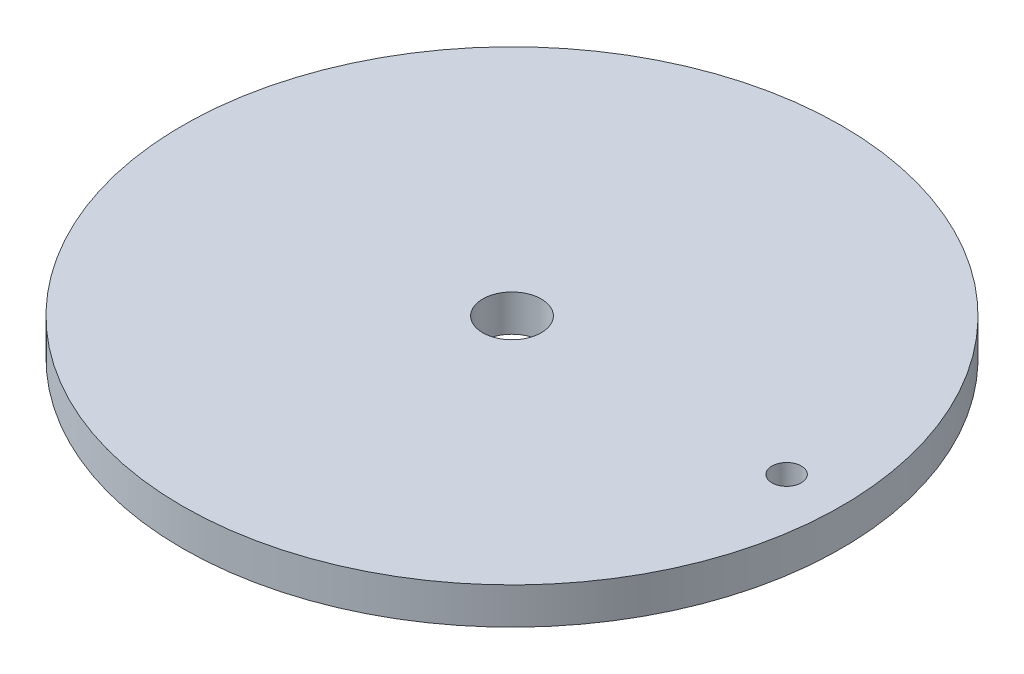
ISO-10303-21;
HEADER;
FILE_DESCRIPTION(('STEP AP214'),'2;1');
FILE_NAME('part.step','',(''),(''),'','','');
FILE_SCHEMA(('AUTOMOTIVE_DESIGN { 1 0 10303 214 1 1 1 1 }'));
ENDSEC;
DATA;
#1=APPLICATION_CONTEXT('core data for automotive mechanical design processes');
#2=APPLICATION_PROTOCOL_DEFINITION('international standard','automotive_design',2000,#1);
#3=PRODUCT_CONTEXT('',#1,'mechanical');
#4=PRODUCT('Part','Part','',(#3));
#5=PRODUCT_RELATED_PRODUCT_CATEGORY('part','',(#4));
#6=PRODUCT_DEFINITION_FORMATION('','',#4);
#7=PRODUCT_DEFINITION_CONTEXT('part definition',#1,'design');
#8=PRODUCT_DEFINITION('design','',#6,#7);
#9=PRODUCT_DEFINITION_SHAPE('','',#8);
#10=(LENGTH_UNIT() NAMED_UNIT(*) SI_UNIT(.MILLI.,.METRE.));
#11=(NAMED_UNIT(*) PLANE_ANGLE_UNIT() SI_UNIT($,.RADIAN.));
#12=(NAMED_UNIT(*) SI_UNIT($,.STERADIAN.) SOLID_ANGLE_UNIT());
#13=UNCERTAINTY_MEASURE_WITH_UNIT(LENGTH_MEASURE(1.E-05),#10,'distance_accuracy_value','');
#14=(GEOMETRIC_REPRESENTATION_CONTEXT(3) GLOBAL_UNCERTAINTY_ASSIGNED_CONTEXT((#13)) GLOBAL_UNIT_ASSIGNED_CONTEXT((#10,
#11,#12)) REPRESENTATION_CONTEXT('',''));
#15=CARTESIAN_POINT('',(0.,0.,0.));
#16=DIRECTION('',(0.,0.,1.));
#17=DIRECTION('',(1.,0.,0.));
#18=AXIS2_PLACEMENT_3D('',#15,#16,#17);
#19=CARTESIAN_POINT('',(0.,5.,0.));
#20=DIRECTION('',(0.,-1.,0.));
#21=DIRECTION('',(0.,0.,-1.));
#22=AXIS2_PLACEMENT_3D('',#19,#20,#21);
#23=CYLINDRICAL_SURFACE('',#22,45.);
#24=CARTESIAN_POINT('',(0.,5.,0.));
#25=DIRECTION('',(0.,1.,0.));
#26=DIRECTION('',(0.,0.,1.));
#27=AXIS2_PLACEMENT_3D('',#24,#25,#26);
#28=CIRCLE('',#27,45.);
#29=CARTESIAN_POINT('',(0.,5.,45.));
#30=VERTEX_POINT('',#29);
#31=EDGE_CURVE('E54',#30,#30,#28,.T.);
#32=ORIENTED_EDGE('',*,*,#31,.F.);
#33=EDGE_LOOP('',(#32));
#34=FACE_BOUND('',#33,.T.);
#35=CARTESIAN_POINT('',(0.,0.,0.));
#36=DIRECTION('',(0.,1.,0.));
#37=DIRECTION('',(0.,0.,1.));
#38=AXIS2_PLACEMENT_3D('',#35,#36,#37);
#39=CIRCLE('',#38,45.);
#40=CARTESIAN_POINT('',(0.,0.,45.));
#41=VERTEX_POINT('',#40);
#42=EDGE_CURVE('E67',#41,#41,#39,.T.);
#43=ORIENTED_EDGE('',*,*,#42,.T.);
#44=EDGE_LOOP('',(#43));
#45=FACE_BOUND('',#44,.T.);
#46=ADVANCED_FACE('F45',(#34,#45),#23,.T.);
#47=CARTESIAN_POINT('',(0.,5.,0.));
#48=DIRECTION('',(0.,-1.,0.));
#49=DIRECTION('',(0.,0.,-1.));
#50=AXIS2_PLACEMENT_3D('',#47,#48,#49);
#51=CYLINDRICAL_SURFACE('',#50,4.);
#52=CARTESIAN_POINT('',(0.,5.,0.));
#53=DIRECTION('',(0.,1.,0.));
#54=DIRECTION('',(0.,0.,1.));
#55=AXIS2_PLACEMENT_3D('',#52,#53,#54);
#56=CIRCLE('',#55,4.);
#57=CARTESIAN_POINT('',(0.,5.,4.));
#58=VERTEX_POINT('',#57);
#59=EDGE_CURVE('E60',#58,#58,#56,.T.);
#60=ORIENTED_EDGE('',*,*,#59,.T.);
#61=EDGE_LOOP('',(#60));
#62=FACE_BOUND('',#61,.T.);
#63=CARTESIAN_POINT('',(0.,0.,0.));
#64=DIRECTION('',(0.,1.,0.));
#65=DIRECTION('',(0.,0.,1.));
#66=AXIS2_PLACEMENT_3D('',#63,#64,#65);
#67=CIRCLE('',#66,4.);
#68=CARTESIAN_POINT('',(0.,0.,4.));
#69=VERTEX_POINT('',#68);
#70=EDGE_CURVE('E64',#69,#69,#67,.T.);
#71=ORIENTED_EDGE('',*,*,#70,.F.);
#72=EDGE_LOOP('',(#71));
#73=FACE_BOUND('',#72,.T.);
#74=ADVANCED_FACE('F47',(#62,#73),#51,.F.);
#75=CARTESIAN_POINT('',(37.5,5.,0.));
#76=DIRECTION('',(0.,-1.,0.));
#77=DIRECTION('',(0.,0.,-1.));
#78=AXIS2_PLACEMENT_3D('',#75,#76,#77);
#79=CYLINDRICAL_SURFACE('',#78,2.);
#80=CARTESIAN_POINT('',(37.5,5.,0.));
#81=DIRECTION('',(0.,1.,0.));
#82=DIRECTION('',(0.,0.,1.));
#83=AXIS2_PLACEMENT_3D('',#80,#81,#82);
#84=CIRCLE('',#83,2.);
#85=CARTESIAN_POINT('',(37.5,5.,2.));
#86=VERTEX_POINT('',#85);
#87=EDGE_CURVE('E10',#86,#86,#84,.T.);
#88=ORIENTED_EDGE('',*,*,#87,.T.);
#89=EDGE_LOOP('',(#88));
#90=FACE_BOUND('',#89,.T.);
#91=CARTESIAN_POINT('',(37.5,0.,0.));
#92=DIRECTION('',(0.,1.,0.));
#93=DIRECTION('',(0.,0.,1.));
#94=AXIS2_PLACEMENT_3D('',#91,#92,#93);
#95=CIRCLE('',#94,2.);
#96=CARTESIAN_POINT('',(37.5,0.,2.));
#97=VERTEX_POINT('',#96);
#98=EDGE_CURVE('E49',#97,#97,#95,.T.);
#99=ORIENTED_EDGE('',*,*,#98,.F.);
#100=EDGE_LOOP('',(#99));
#101=FACE_BOUND('',#100,.T.);
#102=ADVANCED_FACE('F86',(#90,#101),#79,.F.);
#103=CARTESIAN_POINT('',(0.,5.,0.));
#104=DIRECTION('',(0.,1.,0.));
#105=DIRECTION('',(0.,0.,1.));
#106=AXIS2_PLACEMENT_3D('',#103,#104,#105);
#107=PLANE('',#106);
#108=ORIENTED_EDGE('',*,*,#59,.F.);
#109=EDGE_LOOP('',(#108));
#110=FACE_BOUND('',#109,.T.);
#111=ORIENTED_EDGE('',*,*,#31,.T.);
#112=EDGE_LOOP('',(#111));
#113=FACE_BOUND('',#112,.T.);
#114=ORIENTED_EDGE('',*,*,#87,.F.);
#115=EDGE_LOOP('',(#114));
#116=FACE_BOUND('',#115,.T.);
#117=ADVANCED_FACE('F82',(#110,#113,#116),#107,.T.);
#118=CARTESIAN_POINT('',(0.,0.,0.));
#119=DIRECTION('',(0.,1.,0.));
#120=DIRECTION('',(0.,0.,1.));
#121=AXIS2_PLACEMENT_3D('',#118,#119,#120);
#122=PLANE('',#121);
#123=ORIENTED_EDGE('',*,*,#70,.T.);
#124=EDGE_LOOP('',(#123));
#125=FACE_BOUND('',#124,.T.);
#126=ORIENTED_EDGE('',*,*,#42,.F.);
#127=EDGE_LOOP('',(#126));
#128=FACE_BOUND('',#127,.T.);
#129=ORIENTED_EDGE('',*,*,#98,.T.);
#130=EDGE_LOOP('',(#129));
#131=FACE_BOUND('',#130,.T.);
#132=ADVANCED_FACE('F85',(#125,#128,#131),#122,.F.);
#133=CLOSED_SHELL('',(#46,#74,#102,#117,#132));
#134=MANIFOLD_SOLID_BREP('B2',#133);
#135=ADVANCED_BREP_SHAPE_REPRESENTATION('',(#18,#134),#14);
#136=SHAPE_DEFINITION_REPRESENTATION(#9,#135);
ENDSEC;
END-ISO-10303-21;
